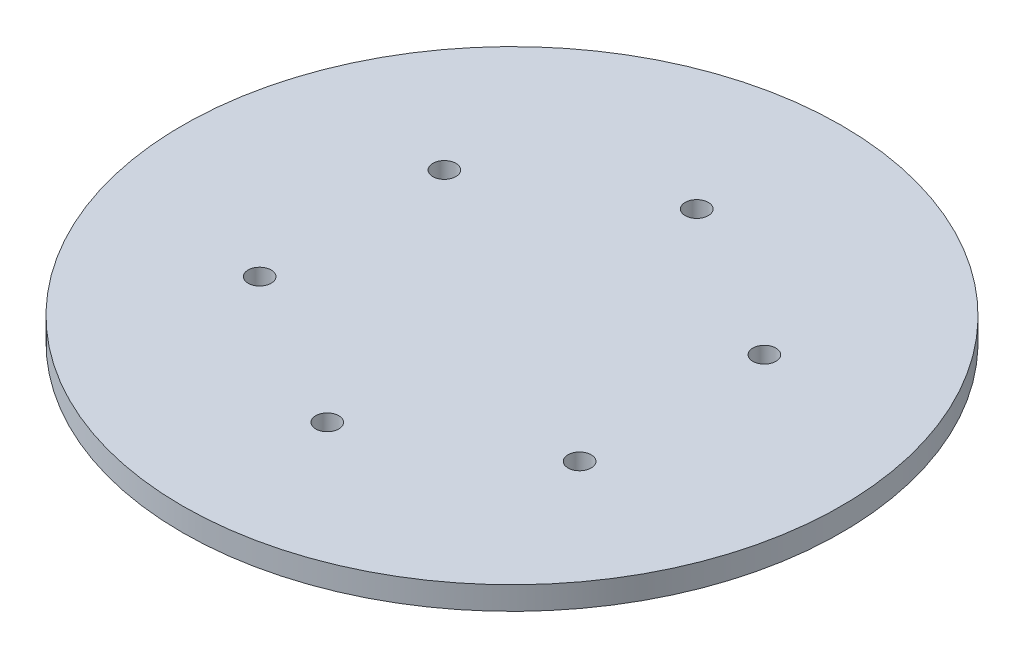
ISO-10303-21;
HEADER;
FILE_DESCRIPTION(('STEP AP214'),'2;1');
FILE_NAME('part.step','',(''),(''),'','','');
FILE_SCHEMA(('AUTOMOTIVE_DESIGN { 1 0 10303 214 1 1 1 1 }'));
ENDSEC;
DATA;
#1=APPLICATION_CONTEXT('core data for automotive mechanical design processes');
#2=APPLICATION_PROTOCOL_DEFINITION('international standard','automotive_design',2000,#1);
#3=PRODUCT_CONTEXT('',#1,'mechanical');
#4=PRODUCT('Part','Part','',(#3));
#5=PRODUCT_RELATED_PRODUCT_CATEGORY('part','',(#4));
#6=PRODUCT_DEFINITION_FORMATION('','',#4);
#7=PRODUCT_DEFINITION_CONTEXT('part definition',#1,'design');
#8=PRODUCT_DEFINITION('design','',#6,#7);
#9=PRODUCT_DEFINITION_SHAPE('','',#8);
#10=(LENGTH_UNIT() NAMED_UNIT(*) SI_UNIT(.MILLI.,.METRE.));
#11=(NAMED_UNIT(*) PLANE_ANGLE_UNIT() SI_UNIT($,.RADIAN.));
#12=(NAMED_UNIT(*) SI_UNIT($,.STERADIAN.) SOLID_ANGLE_UNIT());
#13=UNCERTAINTY_MEASURE_WITH_UNIT(LENGTH_MEASURE(1.E-05),#10,'distance_accuracy_value','');
#14=(GEOMETRIC_REPRESENTATION_CONTEXT(3) GLOBAL_UNCERTAINTY_ASSIGNED_CONTEXT((#13)) GLOBAL_UNIT_ASSIGNED_CONTEXT((#10,
#11,#12)) REPRESENTATION_CONTEXT('',''));
#15=CARTESIAN_POINT('',(0.,0.,0.));
#16=DIRECTION('',(0.,0.,1.));
#17=DIRECTION('',(1.,0.,0.));
#18=AXIS2_PLACEMENT_3D('',#15,#16,#17);
#19=CARTESIAN_POINT('',(0.,10.,0.));
#20=DIRECTION('',(0.,1.,0.));
#21=DIRECTION('',(0.,0.,1.));
#22=AXIS2_PLACEMENT_3D('',#19,#20,#21);
#23=PLANE('',#22);
#24=CARTESIAN_POINT('',(-69.28203230275,10.,40.000000000003));
#25=DIRECTION('',(0.,1.,0.));
#26=DIRECTION('',(0.,0.,1.));
#27=AXIS2_PLACEMENT_3D('',#24,#25,#26);
#28=CIRCLE('',#27,5.00000000000646);
#29=CARTESIAN_POINT('',(-69.28203230275,10.,45.0000000000094));
#30=VERTEX_POINT('',#29);
#31=EDGE_CURVE('E66',#30,#30,#28,.T.);
#32=ORIENTED_EDGE('',*,*,#31,.F.);
#33=EDGE_LOOP('',(#32));
#34=FACE_BOUND('',#33,.T.);
#35=CARTESIAN_POINT('',(69.2820323027602,10.,39.999999999997));
#36=DIRECTION('',(0.,1.,0.));
#37=DIRECTION('',(0.,0.,1.));
#38=AXIS2_PLACEMENT_3D('',#35,#36,#37);
#39=CIRCLE('',#38,5.00000000000438);
#40=CARTESIAN_POINT('',(69.2820323027602,10.,45.0000000000014));
#41=VERTEX_POINT('',#40);
#42=EDGE_CURVE('E54',#41,#41,#39,.T.);
#43=ORIENTED_EDGE('',*,*,#42,.F.);
#44=EDGE_LOOP('',(#43));
#45=FACE_BOUND('',#44,.T.);
#46=CARTESIAN_POINT('',(0.,10.,-80.));
#47=DIRECTION('',(0.,1.,0.));
#48=DIRECTION('',(0.,0.,1.));
#49=AXIS2_PLACEMENT_3D('',#46,#47,#48);
#50=CIRCLE('',#49,5.);
#51=CARTESIAN_POINT('',(0.,10.,-75.));
#52=VERTEX_POINT('',#51);
#53=EDGE_CURVE('E43',#52,#52,#50,.T.);
#54=ORIENTED_EDGE('',*,*,#53,.F.);
#55=EDGE_LOOP('',(#54));
#56=FACE_BOUND('',#55,.T.);
#57=CARTESIAN_POINT('',(0.,10.,0.));
#58=DIRECTION('',(0.,1.,0.));
#59=DIRECTION('',(0.,0.,1.));
#60=AXIS2_PLACEMENT_3D('',#57,#58,#59);
#61=CIRCLE('',#60,142.710997442455);
#62=CARTESIAN_POINT('',(0.,10.,142.710997442455));
#63=VERTEX_POINT('',#62);
#64=EDGE_CURVE('E10',#63,#63,#61,.T.);
#65=ORIENTED_EDGE('',*,*,#64,.T.);
#66=EDGE_LOOP('',(#65));
#67=FACE_BOUND('',#66,.T.);
#68=CARTESIAN_POINT('',(69.2820323027568,10.,-40.000000000003));
#69=DIRECTION('',(0.,1.,0.));
#70=DIRECTION('',(0.,0.,1.));
#71=AXIS2_PLACEMENT_3D('',#68,#69,#70);
#72=CIRCLE('',#71,5.00000000000097);
#73=CARTESIAN_POINT('',(69.2820323027568,10.,-35.000000000002));
#74=VERTEX_POINT('',#73);
#75=EDGE_CURVE('E48',#74,#74,#72,.T.);
#76=ORIENTED_EDGE('',*,*,#75,.F.);
#77=EDGE_LOOP('',(#76));
#78=FACE_BOUND('',#77,.T.);
#79=CARTESIAN_POINT('',(6.8016159145106E-12,10.,80.));
#80=DIRECTION('',(0.,1.,0.));
#81=DIRECTION('',(0.,0.,1.));
#82=AXIS2_PLACEMENT_3D('',#79,#80,#81);
#83=CIRCLE('',#82,5.00000000000704);
#84=CARTESIAN_POINT('',(6.8016159145106E-12,10.,85.000000000007));
#85=VERTEX_POINT('',#84);
#86=EDGE_CURVE('E60',#85,#85,#83,.T.);
#87=ORIENTED_EDGE('',*,*,#86,.F.);
#88=EDGE_LOOP('',(#87));
#89=FACE_BOUND('',#88,.T.);
#90=CARTESIAN_POINT('',(-69.2820323027534,10.,-39.999999999997));
#91=DIRECTION('',(0.,1.,0.));
#92=DIRECTION('',(0.,0.,1.));
#93=AXIS2_PLACEMENT_3D('',#90,#91,#92);
#94=CIRCLE('',#93,5.00000000000345);
#95=CARTESIAN_POINT('',(-69.2820323027534,10.,-34.9999999999935));
#96=VERTEX_POINT('',#95);
#97=EDGE_CURVE('E72',#96,#96,#94,.T.);
#98=ORIENTED_EDGE('',*,*,#97,.F.);
#99=EDGE_LOOP('',(#98));
#100=FACE_BOUND('',#99,.T.);
#101=ADVANCED_FACE('F32',(#34,#45,#56,#67,#78,#89,#100),#23,.T.);
#102=CARTESIAN_POINT('',(0.,0.,0.));
#103=DIRECTION('',(0.,1.,0.));
#104=DIRECTION('',(0.,0.,1.));
#105=AXIS2_PLACEMENT_3D('',#102,#103,#104);
#106=PLANE('',#105);
#107=CARTESIAN_POINT('',(0.,0.,0.));
#108=DIRECTION('',(0.,1.,0.));
#109=DIRECTION('',(0.,0.,1.));
#110=AXIS2_PLACEMENT_3D('',#107,#108,#109);
#111=CIRCLE('',#110,142.710997442455);
#112=CARTESIAN_POINT('',(0.,0.,142.710997442455));
#113=VERTEX_POINT('',#112);
#114=EDGE_CURVE('E36',#113,#113,#111,.T.);
#115=ORIENTED_EDGE('',*,*,#114,.F.);
#116=EDGE_LOOP('',(#115));
#117=FACE_BOUND('',#116,.T.);
#118=CARTESIAN_POINT('',(0.,0.,-80.));
#119=DIRECTION('',(0.,1.,0.));
#120=DIRECTION('',(0.,0.,1.));
#121=AXIS2_PLACEMENT_3D('',#118,#119,#120);
#122=CIRCLE('',#121,5.);
#123=CARTESIAN_POINT('',(0.,0.,-75.));
#124=VERTEX_POINT('',#123);
#125=EDGE_CURVE('E45',#124,#124,#122,.T.);
#126=ORIENTED_EDGE('',*,*,#125,.T.);
#127=EDGE_LOOP('',(#126));
#128=FACE_BOUND('',#127,.T.);
#129=CARTESIAN_POINT('',(69.2820323027568,0.,-40.000000000003));
#130=DIRECTION('',(0.,1.,0.));
#131=DIRECTION('',(0.,0.,1.));
#132=AXIS2_PLACEMENT_3D('',#129,#130,#131);
#133=CIRCLE('',#132,5.00000000000097);
#134=CARTESIAN_POINT('',(69.2820323027568,0.,-35.000000000002));
#135=VERTEX_POINT('',#134);
#136=EDGE_CURVE('E51',#135,#135,#133,.T.);
#137=ORIENTED_EDGE('',*,*,#136,.T.);
#138=EDGE_LOOP('',(#137));
#139=FACE_BOUND('',#138,.T.);
#140=CARTESIAN_POINT('',(69.2820323027602,0.,39.999999999997));
#141=DIRECTION('',(0.,1.,0.));
#142=DIRECTION('',(0.,0.,1.));
#143=AXIS2_PLACEMENT_3D('',#140,#141,#142);
#144=CIRCLE('',#143,5.00000000000438);
#145=CARTESIAN_POINT('',(69.2820323027602,0.,45.0000000000014));
#146=VERTEX_POINT('',#145);
#147=EDGE_CURVE('E57',#146,#146,#144,.T.);
#148=ORIENTED_EDGE('',*,*,#147,.T.);
#149=EDGE_LOOP('',(#148));
#150=FACE_BOUND('',#149,.T.);
#151=CARTESIAN_POINT('',(6.8016159145106E-12,0.,80.));
#152=DIRECTION('',(0.,1.,0.));
#153=DIRECTION('',(0.,0.,1.));
#154=AXIS2_PLACEMENT_3D('',#151,#152,#153);
#155=CIRCLE('',#154,5.00000000000704);
#156=CARTESIAN_POINT('',(6.8016159145106E-12,0.,85.000000000007));
#157=VERTEX_POINT('',#156);
#158=EDGE_CURVE('E63',#157,#157,#155,.T.);
#159=ORIENTED_EDGE('',*,*,#158,.T.);
#160=EDGE_LOOP('',(#159));
#161=FACE_BOUND('',#160,.T.);
#162=CARTESIAN_POINT('',(-69.28203230275,0.,40.000000000003));
#163=DIRECTION('',(0.,1.,0.));
#164=DIRECTION('',(0.,0.,1.));
#165=AXIS2_PLACEMENT_3D('',#162,#163,#164);
#166=CIRCLE('',#165,5.00000000000646);
#167=CARTESIAN_POINT('',(-69.28203230275,0.,45.0000000000094));
#168=VERTEX_POINT('',#167);
#169=EDGE_CURVE('E69',#168,#168,#166,.T.);
#170=ORIENTED_EDGE('',*,*,#169,.T.);
#171=EDGE_LOOP('',(#170));
#172=FACE_BOUND('',#171,.T.);
#173=CARTESIAN_POINT('',(-69.2820323027534,0.,-39.999999999997));
#174=DIRECTION('',(0.,1.,0.));
#175=DIRECTION('',(0.,0.,1.));
#176=AXIS2_PLACEMENT_3D('',#173,#174,#175);
#177=CIRCLE('',#176,5.00000000000345);
#178=CARTESIAN_POINT('',(-69.2820323027534,0.,-34.9999999999935));
#179=VERTEX_POINT('',#178);
#180=EDGE_CURVE('E75',#179,#179,#177,.T.);
#181=ORIENTED_EDGE('',*,*,#180,.T.);
#182=EDGE_LOOP('',(#181));
#183=FACE_BOUND('',#182,.T.);
#184=ADVANCED_FACE('F85',(#117,#128,#139,#150,#161,#172,#183),#106,.F.);
#185=CARTESIAN_POINT('',(0.,10.,0.));
#186=DIRECTION('',(0.,-1.,0.));
#187=DIRECTION('',(0.,0.,-1.));
#188=AXIS2_PLACEMENT_3D('',#185,#186,#187);
#189=CYLINDRICAL_SURFACE('',#188,142.710997442455);
#190=ORIENTED_EDGE('',*,*,#64,.F.);
#191=EDGE_LOOP('',(#190));
#192=FACE_BOUND('',#191,.T.);
#193=ORIENTED_EDGE('',*,*,#114,.T.);
#194=EDGE_LOOP('',(#193));
#195=FACE_BOUND('',#194,.T.);
#196=ADVANCED_FACE('F34',(#192,#195),#189,.T.);
#197=CARTESIAN_POINT('',(0.,10.,-80.));
#198=DIRECTION('',(0.,-1.,0.));
#199=DIRECTION('',(0.,0.,-1.));
#200=AXIS2_PLACEMENT_3D('',#197,#198,#199);
#201=CYLINDRICAL_SURFACE('',#200,5.);
#202=ORIENTED_EDGE('',*,*,#53,.T.);
#203=EDGE_LOOP('',(#202));
#204=FACE_BOUND('',#203,.T.);
#205=ORIENTED_EDGE('',*,*,#125,.F.);
#206=EDGE_LOOP('',(#205));
#207=FACE_BOUND('',#206,.T.);
#208=ADVANCED_FACE('F95',(#204,#207),#201,.F.);
#209=CARTESIAN_POINT('',(69.2820323027568,10.,-40.000000000003));
#210=DIRECTION('',(0.,-1.,0.));
#211=DIRECTION('',(0.,0.,-1.));
#212=AXIS2_PLACEMENT_3D('',#209,#210,#211);
#213=CYLINDRICAL_SURFACE('',#212,5.00000000000097);
#214=ORIENTED_EDGE('',*,*,#75,.T.);
#215=EDGE_LOOP('',(#214));
#216=FACE_BOUND('',#215,.T.);
#217=ORIENTED_EDGE('',*,*,#136,.F.);
#218=EDGE_LOOP('',(#217));
#219=FACE_BOUND('',#218,.T.);
#220=ADVANCED_FACE('F98',(#216,#219),#213,.F.);
#221=CARTESIAN_POINT('',(69.2820323027602,10.,39.999999999997));
#222=DIRECTION('',(0.,-1.,0.));
#223=DIRECTION('',(0.,0.,-1.));
#224=AXIS2_PLACEMENT_3D('',#221,#222,#223);
#225=CYLINDRICAL_SURFACE('',#224,5.00000000000438);
#226=ORIENTED_EDGE('',*,*,#42,.T.);
#227=EDGE_LOOP('',(#226));
#228=FACE_BOUND('',#227,.T.);
#229=ORIENTED_EDGE('',*,*,#147,.F.);
#230=EDGE_LOOP('',(#229));
#231=FACE_BOUND('',#230,.T.);
#232=ADVANCED_FACE('F102',(#228,#231),#225,.F.);
#233=CARTESIAN_POINT('',(6.8016159145106E-12,10.,80.));
#234=DIRECTION('',(0.,-1.,0.));
#235=DIRECTION('',(0.,0.,-1.));
#236=AXIS2_PLACEMENT_3D('',#233,#234,#235);
#237=CYLINDRICAL_SURFACE('',#236,5.00000000000704);
#238=ORIENTED_EDGE('',*,*,#86,.T.);
#239=EDGE_LOOP('',(#238));
#240=FACE_BOUND('',#239,.T.);
#241=ORIENTED_EDGE('',*,*,#158,.F.);
#242=EDGE_LOOP('',(#241));
#243=FACE_BOUND('',#242,.T.);
#244=ADVANCED_FACE('F106',(#240,#243),#237,.F.);
#245=CARTESIAN_POINT('',(-69.28203230275,10.,40.000000000003));
#246=DIRECTION('',(0.,-1.,0.));
#247=DIRECTION('',(0.,0.,-1.));
#248=AXIS2_PLACEMENT_3D('',#245,#246,#247);
#249=CYLINDRICAL_SURFACE('',#248,5.00000000000646);
#250=ORIENTED_EDGE('',*,*,#31,.T.);
#251=EDGE_LOOP('',(#250));
#252=FACE_BOUND('',#251,.T.);
#253=ORIENTED_EDGE('',*,*,#169,.F.);
#254=EDGE_LOOP('',(#253));
#255=FACE_BOUND('',#254,.T.);
#256=ADVANCED_FACE('F110',(#252,#255),#249,.F.);
#257=CARTESIAN_POINT('',(-69.2820323027534,10.,-39.999999999997));
#258=DIRECTION('',(0.,-1.,0.));
#259=DIRECTION('',(0.,0.,-1.));
#260=AXIS2_PLACEMENT_3D('',#257,#258,#259);
#261=CYLINDRICAL_SURFACE('',#260,5.00000000000345);
#262=ORIENTED_EDGE('',*,*,#97,.T.);
#263=EDGE_LOOP('',(#262));
#264=FACE_BOUND('',#263,.T.);
#265=ORIENTED_EDGE('',*,*,#180,.F.);
#266=EDGE_LOOP('',(#265));
#267=FACE_BOUND('',#266,.T.);
#268=ADVANCED_FACE('F81',(#264,#267),#261,.F.);
#269=CLOSED_SHELL('',(#101,#184,#196,#208,#220,#232,#244,#256,#268));
#270=MANIFOLD_SOLID_BREP('B2',#269);
#271=ADVANCED_BREP_SHAPE_REPRESENTATION('',(#18,#270),#14);
#272=SHAPE_DEFINITION_REPRESENTATION(#9,#271);
ENDSEC;
END-ISO-10303-21;
